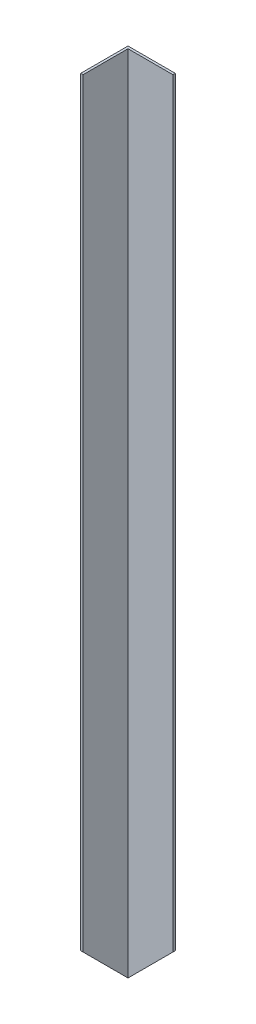
ISO-10303-21;
HEADER;
FILE_DESCRIPTION(('STEP AP214'),'2;1');
FILE_NAME('part.step','',(''),(''),'','','');
FILE_SCHEMA(('AUTOMOTIVE_DESIGN { 1 0 10303 214 1 1 1 1 }'));
ENDSEC;
DATA;
#1=APPLICATION_CONTEXT('core data for automotive mechanical design processes');
#2=APPLICATION_PROTOCOL_DEFINITION('international standard','automotive_design',2000,#1);
#3=PRODUCT_CONTEXT('',#1,'mechanical');
#4=PRODUCT('Part','Part','',(#3));
#5=PRODUCT_RELATED_PRODUCT_CATEGORY('part','',(#4));
#6=PRODUCT_DEFINITION_FORMATION('','',#4);
#7=PRODUCT_DEFINITION_CONTEXT('part definition',#1,'design');
#8=PRODUCT_DEFINITION('design','',#6,#7);
#9=PRODUCT_DEFINITION_SHAPE('','',#8);
#10=(LENGTH_UNIT() NAMED_UNIT(*) SI_UNIT(.MILLI.,.METRE.));
#11=(NAMED_UNIT(*) PLANE_ANGLE_UNIT() SI_UNIT($,.RADIAN.));
#12=(NAMED_UNIT(*) SI_UNIT($,.STERADIAN.) SOLID_ANGLE_UNIT());
#13=UNCERTAINTY_MEASURE_WITH_UNIT(LENGTH_MEASURE(1.E-05),#10,'distance_accuracy_value','');
#14=(GEOMETRIC_REPRESENTATION_CONTEXT(3) GLOBAL_UNCERTAINTY_ASSIGNED_CONTEXT((#13)) GLOBAL_UNIT_ASSIGNED_CONTEXT((#10,
#11,#12)) REPRESENTATION_CONTEXT('',''));
#15=CARTESIAN_POINT('',(0.,0.,0.));
#16=DIRECTION('',(0.,0.,1.));
#17=DIRECTION('',(1.,0.,0.));
#18=AXIS2_PLACEMENT_3D('',#15,#16,#17);
#19=CARTESIAN_POINT('',(-20.,682.,-20.1136363636364));
#20=DIRECTION('',(1.,0.,0.));
#21=DIRECTION('',(0.,0.,-1.));
#22=AXIS2_PLACEMENT_3D('',#19,#20,#21);
#23=PLANE('',#22);
#24=DIRECTION('',(0.,-1.,0.));
#25=VECTOR('',#24,1.);
#26=CARTESIAN_POINT('',(-20.,682.,-20.1136363636364));
#27=LINE('',#26,#25);
#28=CARTESIAN_POINT('',(-20.,682.,-20.1136363636364));
#29=VERTEX_POINT('',#28);
#30=CARTESIAN_POINT('',(-20.,0.,-20.1136363636364));
#31=VERTEX_POINT('',#30);
#32=EDGE_CURVE('E99',#29,#31,#27,.T.);
#33=ORIENTED_EDGE('',*,*,#32,.T.);
#34=DIRECTION('',(0.,-0.707106781186544,-0.707106781186551));
#35=VECTOR('',#34,1.);
#36=CARTESIAN_POINT('',(-20.,0.,-20.1136363636364));
#37=LINE('',#36,#35);
#38=CARTESIAN_POINT('',(-20.,39.9999999999996,19.8863636363636));
#39=VERTEX_POINT('',#38);
#40=EDGE_CURVE('E87',#39,#31,#37,.T.);
#41=ORIENTED_EDGE('',*,*,#40,.F.);
#42=DIRECTION('',(0.,-1.,0.));
#43=VECTOR('',#42,1.);
#44=CARTESIAN_POINT('',(-20.,682.,19.8863636363636));
#45=LINE('',#44,#43);
#46=CARTESIAN_POINT('',(-20.,682.,19.8863636363636));
#47=VERTEX_POINT('',#46);
#48=EDGE_CURVE('E40',#47,#39,#45,.T.);
#49=ORIENTED_EDGE('',*,*,#48,.F.);
#50=DIRECTION('',(0.,0.,1.));
#51=VECTOR('',#50,1.);
#52=CARTESIAN_POINT('',(-20.,682.,-20.1136363636364));
#53=LINE('',#52,#51);
#54=EDGE_CURVE('E123',#29,#47,#53,.T.);
#55=ORIENTED_EDGE('',*,*,#54,.F.);
#56=EDGE_LOOP('',(#33,#41,#49,#55));
#57=FACE_BOUND('',#56,.T.);
#58=ADVANCED_FACE('F33',(#57),#23,.F.);
#59=CARTESIAN_POINT('',(-20.,682.,19.8863636363636));
#60=DIRECTION('',(0.,0.,-1.));
#61=DIRECTION('',(-1.,0.,0.));
#62=AXIS2_PLACEMENT_3D('',#59,#60,#61);
#63=PLANE('',#62);
#64=ORIENTED_EDGE('',*,*,#48,.T.);
#65=DIRECTION('',(-1.,0.,0.));
#66=VECTOR('',#65,1.);
#67=CARTESIAN_POINT('',(570.,39.9999999999996,19.8863636363635));
#68=LINE('',#67,#66);
#69=CARTESIAN_POINT('',(-18.,39.9999999999996,19.8863636363636));
#70=VERTEX_POINT('',#69);
#71=EDGE_CURVE('E84',#70,#39,#68,.T.);
#72=ORIENTED_EDGE('',*,*,#71,.F.);
#73=DIRECTION('',(0.,-1.,0.));
#74=VECTOR('',#73,1.);
#75=CARTESIAN_POINT('',(-18.,682.,19.8863636363636));
#76=LINE('',#75,#74);
#77=CARTESIAN_POINT('',(-18.,682.,19.8863636363636));
#78=VERTEX_POINT('',#77);
#79=EDGE_CURVE('E103',#78,#70,#76,.T.);
#80=ORIENTED_EDGE('',*,*,#79,.F.);
#81=DIRECTION('',(1.,0.,0.));
#82=VECTOR('',#81,1.);
#83=CARTESIAN_POINT('',(-20.,682.,19.8863636363636));
#84=LINE('',#83,#82);
#85=EDGE_CURVE('E102',#47,#78,#84,.T.);
#86=ORIENTED_EDGE('',*,*,#85,.F.);
#87=EDGE_LOOP('',(#64,#72,#80,#86));
#88=FACE_BOUND('',#87,.T.);
#89=ADVANCED_FACE('F101',(#88),#63,.F.);
#90=CARTESIAN_POINT('',(-18.,682.,-18.1136363636364));
#91=DIRECTION('',(-1.,0.,0.));
#92=DIRECTION('',(0.,0.,1.));
#93=AXIS2_PLACEMENT_3D('',#90,#91,#92);
#94=PLANE('',#93);
#95=ORIENTED_EDGE('',*,*,#79,.T.);
#96=DIRECTION('',(0.,-0.707106781186544,-0.707106781186551));
#97=VECTOR('',#96,1.);
#98=CARTESIAN_POINT('',(-18.,341.999999999997,321.886363636364));
#99=LINE('',#98,#97);
#100=CARTESIAN_POINT('',(-18.,2.,-18.1136363636364));
#101=VERTEX_POINT('',#100);
#102=EDGE_CURVE('E89',#70,#101,#99,.T.);
#103=ORIENTED_EDGE('',*,*,#102,.T.);
#104=DIRECTION('',(0.,-1.,0.));
#105=VECTOR('',#104,1.);
#106=CARTESIAN_POINT('',(-18.,682.,-18.1136363636364));
#107=LINE('',#106,#105);
#108=CARTESIAN_POINT('',(-18.,682.,-18.1136363636364));
#109=VERTEX_POINT('',#108);
#110=EDGE_CURVE('E104',#109,#101,#107,.T.);
#111=ORIENTED_EDGE('',*,*,#110,.F.);
#112=DIRECTION('',(0.,0.,-1.));
#113=VECTOR('',#112,1.);
#114=CARTESIAN_POINT('',(-18.,682.,-18.1136363636364));
#115=LINE('',#114,#113);
#116=EDGE_CURVE('E120',#78,#109,#115,.T.);
#117=ORIENTED_EDGE('',*,*,#116,.F.);
#118=EDGE_LOOP('',(#95,#103,#111,#117));
#119=FACE_BOUND('',#118,.T.);
#120=ADVANCED_FACE('F136',(#119),#94,.F.);
#121=CARTESIAN_POINT('',(-18.,682.,-18.1136363636364));
#122=DIRECTION('',(0.,0.,-1.));
#123=DIRECTION('',(-1.,0.,0.));
#124=AXIS2_PLACEMENT_3D('',#121,#122,#123);
#125=PLANE('',#124);
#126=ORIENTED_EDGE('',*,*,#110,.T.);
#127=DIRECTION('',(0.707106781186547,0.707106781186549,0.));
#128=VECTOR('',#127,1.);
#129=CARTESIAN_POINT('',(322.,342.000000000001,-18.1136363636364));
#130=LINE('',#129,#128);
#131=CARTESIAN_POINT('',(20.,40.0000000000001,-18.1136363636364));
#132=VERTEX_POINT('',#131);
#133=EDGE_CURVE('E125',#101,#132,#130,.T.);
#134=ORIENTED_EDGE('',*,*,#133,.T.);
#135=DIRECTION('',(0.,-1.,0.));
#136=VECTOR('',#135,1.);
#137=CARTESIAN_POINT('',(20.,682.,-18.1136363636364));
#138=LINE('',#137,#136);
#139=CARTESIAN_POINT('',(20.,682.,-18.1136363636364));
#140=VERTEX_POINT('',#139);
#141=EDGE_CURVE('E109',#140,#132,#138,.T.);
#142=ORIENTED_EDGE('',*,*,#141,.F.);
#143=DIRECTION('',(1.,0.,0.));
#144=VECTOR('',#143,1.);
#145=CARTESIAN_POINT('',(-18.,682.,-18.1136363636364));
#146=LINE('',#145,#144);
#147=EDGE_CURVE('E118',#109,#140,#146,.T.);
#148=ORIENTED_EDGE('',*,*,#147,.F.);
#149=EDGE_LOOP('',(#126,#134,#142,#148));
#150=FACE_BOUND('',#149,.T.);
#151=ADVANCED_FACE('F144',(#150),#125,.F.);
#152=CARTESIAN_POINT('',(20.,682.,-20.1136363636364));
#153=DIRECTION('',(-1.,0.,0.));
#154=DIRECTION('',(0.,0.,1.));
#155=AXIS2_PLACEMENT_3D('',#152,#153,#154);
#156=PLANE('',#155);
#157=ORIENTED_EDGE('',*,*,#141,.T.);
#158=DIRECTION('',(0.,0.,-1.));
#159=VECTOR('',#158,1.);
#160=CARTESIAN_POINT('',(20.,40.0000000000001,569.886363636364));
#161=LINE('',#160,#159);
#162=CARTESIAN_POINT('',(20.,40.0000000000001,-20.1136363636364));
#163=VERTEX_POINT('',#162);
#164=EDGE_CURVE('E128',#132,#163,#161,.T.);
#165=ORIENTED_EDGE('',*,*,#164,.T.);
#166=DIRECTION('',(0.,-1.,0.));
#167=VECTOR('',#166,1.);
#168=CARTESIAN_POINT('',(20.,682.,-20.1136363636364));
#169=LINE('',#168,#167);
#170=CARTESIAN_POINT('',(20.,682.,-20.1136363636364));
#171=VERTEX_POINT('',#170);
#172=EDGE_CURVE('E112',#171,#163,#169,.T.);
#173=ORIENTED_EDGE('',*,*,#172,.F.);
#174=DIRECTION('',(0.,0.,-1.));
#175=VECTOR('',#174,1.);
#176=CARTESIAN_POINT('',(20.,682.,-20.1136363636364));
#177=LINE('',#176,#175);
#178=EDGE_CURVE('E52',#140,#171,#177,.T.);
#179=ORIENTED_EDGE('',*,*,#178,.F.);
#180=EDGE_LOOP('',(#157,#165,#173,#179));
#181=FACE_BOUND('',#180,.T.);
#182=ADVANCED_FACE('F154',(#181),#156,.F.);
#183=CARTESIAN_POINT('',(-20.,682.,-20.1136363636364));
#184=DIRECTION('',(0.,0.,1.));
#185=DIRECTION('',(1.,0.,0.));
#186=AXIS2_PLACEMENT_3D('',#183,#184,#185);
#187=PLANE('',#186);
#188=ORIENTED_EDGE('',*,*,#172,.T.);
#189=DIRECTION('',(0.707106781186546,0.707106781186548,0.));
#190=VECTOR('',#189,1.);
#191=CARTESIAN_POINT('',(-20.,0.,-20.1136363636364));
#192=LINE('',#191,#190);
#193=EDGE_CURVE('E131',#31,#163,#192,.T.);
#194=ORIENTED_EDGE('',*,*,#193,.F.);
#195=ORIENTED_EDGE('',*,*,#32,.F.);
#196=DIRECTION('',(-1.,0.,0.));
#197=VECTOR('',#196,1.);
#198=CARTESIAN_POINT('',(-20.,682.,-20.1136363636364));
#199=LINE('',#198,#197);
#200=EDGE_CURVE('E47',#171,#29,#199,.T.);
#201=ORIENTED_EDGE('',*,*,#200,.F.);
#202=EDGE_LOOP('',(#188,#194,#195,#201));
#203=FACE_BOUND('',#202,.T.);
#204=ADVANCED_FACE('F147',(#203),#187,.F.);
#205=CARTESIAN_POINT('',(0.,682.,0.));
#206=DIRECTION('',(0.,1.,0.));
#207=DIRECTION('',(0.,0.,1.));
#208=AXIS2_PLACEMENT_3D('',#205,#206,#207);
#209=PLANE('',#208);
#210=ORIENTED_EDGE('',*,*,#54,.T.);
#211=ORIENTED_EDGE('',*,*,#85,.T.);
#212=ORIENTED_EDGE('',*,*,#116,.T.);
#213=ORIENTED_EDGE('',*,*,#147,.T.);
#214=ORIENTED_EDGE('',*,*,#178,.T.);
#215=ORIENTED_EDGE('',*,*,#200,.T.);
#216=EDGE_LOOP('',(#210,#211,#212,#213,#214,#215));
#217=FACE_BOUND('',#216,.T.);
#218=ADVANCED_FACE('F145',(#217),#209,.T.);
#219=CARTESIAN_POINT('',(-20.,0.,569.886363636364));
#220=DIRECTION('',(-0.707106781186549,0.707106781186547,0.));
#221=DIRECTION('',(-0.707106781186547,-0.707106781186549,0.));
#222=AXIS2_PLACEMENT_3D('',#219,#220,#221);
#223=PLANE('',#222);
#224=ORIENTED_EDGE('',*,*,#133,.F.);
#225=DIRECTION('',(-0.577350269189623,-0.577350269189624,-0.57735026918963));
#226=VECTOR('',#225,1.);
#227=CARTESIAN_POINT('',(176.666666666667,196.666666666668,176.553030303033));
#228=LINE('',#227,#226);
#229=EDGE_CURVE('E11',#101,#31,#228,.T.);
#230=ORIENTED_EDGE('',*,*,#229,.T.);
#231=ORIENTED_EDGE('',*,*,#193,.T.);
#232=ORIENTED_EDGE('',*,*,#164,.F.);
#233=EDGE_LOOP('',(#224,#230,#231,#232));
#234=FACE_BOUND('',#233,.T.);
#235=ADVANCED_FACE('F140',(#234),#223,.F.);
#236=CARTESIAN_POINT('',(570.,0.,-20.1136363636365));
#237=DIRECTION('',(0.,0.707106781186551,-0.707106781186544));
#238=DIRECTION('',(0.,0.707106781186544,0.707106781186551));
#239=AXIS2_PLACEMENT_3D('',#236,#237,#238);
#240=PLANE('',#239);
#241=ORIENTED_EDGE('',*,*,#71,.T.);
#242=ORIENTED_EDGE('',*,*,#40,.T.);
#243=ORIENTED_EDGE('',*,*,#229,.F.);
#244=ORIENTED_EDGE('',*,*,#102,.F.);
#245=EDGE_LOOP('',(#241,#242,#243,#244));
#246=FACE_BOUND('',#245,.T.);
#247=ADVANCED_FACE('F86',(#246),#240,.F.);
#248=CLOSED_SHELL('',(#58,#89,#120,#151,#182,#204,#218,#235,#247));
#249=MANIFOLD_SOLID_BREP('B2',#248);
#250=ADVANCED_BREP_SHAPE_REPRESENTATION('',(#18,#249),#14);
#251=SHAPE_DEFINITION_REPRESENTATION(#9,#250);
ENDSEC;
END-ISO-10303-21;
